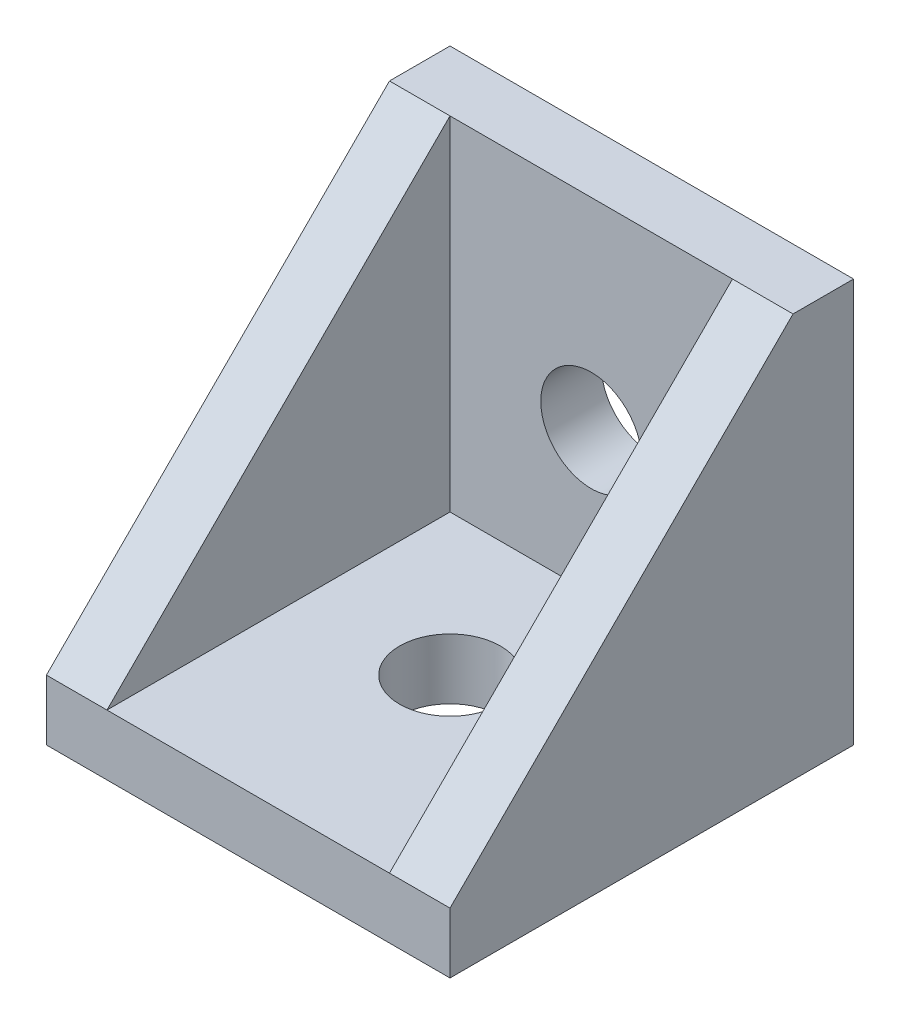
ISO-10303-21;
HEADER;
FILE_DESCRIPTION(('STEP AP214'),'2;1');
FILE_NAME('part.step','',(''),(''),'','','');
FILE_SCHEMA(('AUTOMOTIVE_DESIGN { 1 0 10303 214 1 1 1 1 }'));
ENDSEC;
DATA;
#1=APPLICATION_CONTEXT('core data for automotive mechanical design processes');
#2=APPLICATION_PROTOCOL_DEFINITION('international standard','automotive_design',2000,#1);
#3=PRODUCT_CONTEXT('',#1,'mechanical');
#4=PRODUCT('Part','Part','',(#3));
#5=PRODUCT_RELATED_PRODUCT_CATEGORY('part','',(#4));
#6=PRODUCT_DEFINITION_FORMATION('','',#4);
#7=PRODUCT_DEFINITION_CONTEXT('part definition',#1,'design');
#8=PRODUCT_DEFINITION('design','',#6,#7);
#9=PRODUCT_DEFINITION_SHAPE('','',#8);
#10=(LENGTH_UNIT() NAMED_UNIT(*) SI_UNIT(.MILLI.,.METRE.));
#11=(NAMED_UNIT(*) PLANE_ANGLE_UNIT() SI_UNIT($,.RADIAN.));
#12=(NAMED_UNIT(*) SI_UNIT($,.STERADIAN.) SOLID_ANGLE_UNIT());
#13=UNCERTAINTY_MEASURE_WITH_UNIT(LENGTH_MEASURE(1.E-05),#10,'distance_accuracy_value','');
#14=(GEOMETRIC_REPRESENTATION_CONTEXT(3) GLOBAL_UNCERTAINTY_ASSIGNED_CONTEXT((#13)) GLOBAL_UNIT_ASSIGNED_CONTEXT((#10,
#11,#12)) REPRESENTATION_CONTEXT('',''));
#15=CARTESIAN_POINT('',(0.,0.,0.));
#16=DIRECTION('',(0.,0.,1.));
#17=DIRECTION('',(1.,0.,0.));
#18=AXIS2_PLACEMENT_3D('',#15,#16,#17);
#19=CARTESIAN_POINT('',(-20.,3.,20.));
#20=DIRECTION('',(0.,-0.707106781186547,-0.707106781186548));
#21=DIRECTION('',(0.,-0.707106781186548,0.707106781186547));
#22=AXIS2_PLACEMENT_3D('',#19,#20,#21);
#23=PLANE('',#22);
#24=DIRECTION('',(0.,0.707106781186548,-0.707106781186547));
#25=VECTOR('',#24,1.);
#26=CARTESIAN_POINT('',(-3.,11.5,11.5));
#27=LINE('',#26,#25);
#28=CARTESIAN_POINT('',(-3.,3.,20.));
#29=VERTEX_POINT('',#28);
#30=CARTESIAN_POINT('',(-3.,20.,3.));
#31=VERTEX_POINT('',#30);
#32=EDGE_CURVE('E137',#29,#31,#27,.T.);
#33=ORIENTED_EDGE('',*,*,#32,.F.);
#34=DIRECTION('',(-1.,0.,0.));
#35=VECTOR('',#34,1.);
#36=CARTESIAN_POINT('',(-20.,3.,20.));
#37=LINE('',#36,#35);
#38=CARTESIAN_POINT('',(0.,3.,20.));
#39=VERTEX_POINT('',#38);
#40=EDGE_CURVE('E42',#39,#29,#37,.T.);
#41=ORIENTED_EDGE('',*,*,#40,.F.);
#42=DIRECTION('',(0.,-0.707106781186548,0.707106781186547));
#43=VECTOR('',#42,1.);
#44=CARTESIAN_POINT('',(0.,2.25,20.75));
#45=LINE('',#44,#43);
#46=CARTESIAN_POINT('',(0.,20.,3.));
#47=VERTEX_POINT('',#46);
#48=EDGE_CURVE('E153',#47,#39,#45,.T.);
#49=ORIENTED_EDGE('',*,*,#48,.F.);
#50=DIRECTION('',(1.,0.,0.));
#51=VECTOR('',#50,1.);
#52=CARTESIAN_POINT('',(-15.,20.,3.));
#53=LINE('',#52,#51);
#54=EDGE_CURVE('E150',#31,#47,#53,.T.);
#55=ORIENTED_EDGE('',*,*,#54,.F.);
#56=EDGE_LOOP('',(#33,#41,#49,#55));
#57=FACE_BOUND('',#56,.T.);
#58=ADVANCED_FACE('F17',(#57),#23,.F.);
#59=CARTESIAN_POINT('',(-20.,3.,20.));
#60=DIRECTION('',(0.,-0.707106781186547,-0.707106781186548));
#61=DIRECTION('',(0.,-0.707106781186548,0.707106781186547));
#62=AXIS2_PLACEMENT_3D('',#59,#60,#61);
#63=PLANE('',#62);
#64=DIRECTION('',(0.,-0.707106781186548,0.707106781186547));
#65=VECTOR('',#64,1.);
#66=CARTESIAN_POINT('',(-17.,7.25,15.75));
#67=LINE('',#66,#65);
#68=CARTESIAN_POINT('',(-17.,20.,3.));
#69=VERTEX_POINT('',#68);
#70=CARTESIAN_POINT('',(-17.,3.,20.));
#71=VERTEX_POINT('',#70);
#72=EDGE_CURVE('E219',#69,#71,#67,.T.);
#73=ORIENTED_EDGE('',*,*,#72,.F.);
#74=DIRECTION('',(1.,0.,0.));
#75=VECTOR('',#74,1.);
#76=CARTESIAN_POINT('',(-15.,20.,3.));
#77=LINE('',#76,#75);
#78=CARTESIAN_POINT('',(-20.,20.,3.));
#79=VERTEX_POINT('',#78);
#80=EDGE_CURVE('E162',#79,#69,#77,.T.);
#81=ORIENTED_EDGE('',*,*,#80,.F.);
#82=DIRECTION('',(0.,0.707106781186548,-0.707106781186547));
#83=VECTOR('',#82,1.);
#84=CARTESIAN_POINT('',(-20.,7.25,15.75));
#85=LINE('',#84,#83);
#86=CARTESIAN_POINT('',(-20.,3.,20.));
#87=VERTEX_POINT('',#86);
#88=EDGE_CURVE('E11',#87,#79,#85,.T.);
#89=ORIENTED_EDGE('',*,*,#88,.F.);
#90=DIRECTION('',(-1.,0.,0.));
#91=VECTOR('',#90,1.);
#92=CARTESIAN_POINT('',(-20.,3.,20.));
#93=LINE('',#92,#91);
#94=EDGE_CURVE('E189',#71,#87,#93,.T.);
#95=ORIENTED_EDGE('',*,*,#94,.F.);
#96=EDGE_LOOP('',(#73,#81,#89,#95));
#97=FACE_BOUND('',#96,.T.);
#98=ADVANCED_FACE('F276',(#97),#63,.F.);
#99=CARTESIAN_POINT('',(-20.,0.,0.));
#100=DIRECTION('',(-1.,0.,0.));
#101=DIRECTION('',(0.,0.,1.));
#102=AXIS2_PLACEMENT_3D('',#99,#100,#101);
#103=PLANE('',#102);
#104=ORIENTED_EDGE('',*,*,#88,.T.);
#105=DIRECTION('',(0.,0.,1.));
#106=VECTOR('',#105,1.);
#107=CARTESIAN_POINT('',(-20.,20.,0.));
#108=LINE('',#107,#106);
#109=CARTESIAN_POINT('',(-20.,20.,0.));
#110=VERTEX_POINT('',#109);
#111=EDGE_CURVE('E329',#110,#79,#108,.T.);
#112=ORIENTED_EDGE('',*,*,#111,.F.);
#113=DIRECTION('',(0.,1.,0.));
#114=VECTOR('',#113,1.);
#115=CARTESIAN_POINT('',(-20.,0.,0.));
#116=LINE('',#115,#114);
#117=CARTESIAN_POINT('',(-20.,0.,0.));
#118=VERTEX_POINT('',#117);
#119=EDGE_CURVE('E179',#118,#110,#116,.T.);
#120=ORIENTED_EDGE('',*,*,#119,.F.);
#121=DIRECTION('',(0.,0.,1.));
#122=VECTOR('',#121,1.);
#123=CARTESIAN_POINT('',(-20.,0.,0.));
#124=LINE('',#123,#122);
#125=CARTESIAN_POINT('',(-20.,0.,20.));
#126=VERTEX_POINT('',#125);
#127=EDGE_CURVE('E28',#118,#126,#124,.T.);
#128=ORIENTED_EDGE('',*,*,#127,.T.);
#129=DIRECTION('',(0.,1.,0.));
#130=VECTOR('',#129,1.);
#131=CARTESIAN_POINT('',(-20.,0.,20.));
#132=LINE('',#131,#130);
#133=EDGE_CURVE('E222',#126,#87,#132,.T.);
#134=ORIENTED_EDGE('',*,*,#133,.T.);
#135=EDGE_LOOP('',(#104,#112,#120,#128,#134));
#136=FACE_BOUND('',#135,.T.);
#137=ADVANCED_FACE('F280',(#136),#103,.T.);
#138=CARTESIAN_POINT('',(-17.,20.,20.));
#139=DIRECTION('',(-1.,0.,0.));
#140=DIRECTION('',(0.,0.,1.));
#141=AXIS2_PLACEMENT_3D('',#138,#139,#140);
#142=PLANE('',#141);
#143=ORIENTED_EDGE('',*,*,#72,.T.);
#144=DIRECTION('',(0.,0.,-1.));
#145=VECTOR('',#144,1.);
#146=CARTESIAN_POINT('',(-17.,3.,20.));
#147=LINE('',#146,#145);
#148=CARTESIAN_POINT('',(-17.,3.,3.));
#149=VERTEX_POINT('',#148);
#150=EDGE_CURVE('E216',#71,#149,#147,.T.);
#151=ORIENTED_EDGE('',*,*,#150,.T.);
#152=DIRECTION('',(0.,-1.,0.));
#153=VECTOR('',#152,1.);
#154=CARTESIAN_POINT('',(-17.,20.,3.));
#155=LINE('',#154,#153);
#156=EDGE_CURVE('E109',#69,#149,#155,.T.);
#157=ORIENTED_EDGE('',*,*,#156,.F.);
#158=EDGE_LOOP('',(#143,#151,#157));
#159=FACE_BOUND('',#158,.T.);
#160=ADVANCED_FACE('F284',(#159),#142,.F.);
#161=CARTESIAN_POINT('',(-10.,20.,10.));
#162=DIRECTION('',(0.,1.,0.));
#163=DIRECTION('',(1.,0.,0.));
#164=AXIS2_PLACEMENT_3D('',#161,#162,#163);
#165=PLANE('',#164);
#166=ORIENTED_EDGE('',*,*,#80,.T.);
#167=DIRECTION('',(1.,0.,0.));
#168=VECTOR('',#167,1.);
#169=CARTESIAN_POINT('',(-13.5,20.,3.));
#170=LINE('',#169,#168);
#171=EDGE_CURVE('E157',#69,#31,#170,.T.);
#172=ORIENTED_EDGE('',*,*,#171,.T.);
#173=ORIENTED_EDGE('',*,*,#54,.T.);
#174=DIRECTION('',(0.,0.,-1.));
#175=VECTOR('',#174,1.);
#176=CARTESIAN_POINT('',(0.,20.,20.));
#177=LINE('',#176,#175);
#178=CARTESIAN_POINT('',(0.,20.,0.));
#179=VERTEX_POINT('',#178);
#180=EDGE_CURVE('E158',#47,#179,#177,.T.);
#181=ORIENTED_EDGE('',*,*,#180,.T.);
#182=DIRECTION('',(-1.,0.,0.));
#183=VECTOR('',#182,1.);
#184=CARTESIAN_POINT('',(0.,20.,0.));
#185=LINE('',#184,#183);
#186=EDGE_CURVE('E117',#179,#110,#185,.T.);
#187=ORIENTED_EDGE('',*,*,#186,.T.);
#188=ORIENTED_EDGE('',*,*,#111,.T.);
#189=EDGE_LOOP('',(#166,#172,#173,#181,#187,#188));
#190=FACE_BOUND('',#189,.T.);
#191=ADVANCED_FACE('F160',(#190),#165,.T.);
#192=CARTESIAN_POINT('',(0.,0.,20.));
#193=DIRECTION('',(1.,0.,0.));
#194=DIRECTION('',(0.,1.,0.));
#195=AXIS2_PLACEMENT_3D('',#192,#193,#194);
#196=PLANE('',#195);
#197=ORIENTED_EDGE('',*,*,#48,.T.);
#198=DIRECTION('',(0.,1.,0.));
#199=VECTOR('',#198,1.);
#200=CARTESIAN_POINT('',(0.,0.,20.));
#201=LINE('',#200,#199);
#202=CARTESIAN_POINT('',(0.,0.,20.));
#203=VERTEX_POINT('',#202);
#204=EDGE_CURVE('E190',#203,#39,#201,.T.);
#205=ORIENTED_EDGE('',*,*,#204,.F.);
#206=DIRECTION('',(0.,0.,-1.));
#207=VECTOR('',#206,1.);
#208=CARTESIAN_POINT('',(0.,0.,20.));
#209=LINE('',#208,#207);
#210=CARTESIAN_POINT('',(0.,0.,0.));
#211=VERTEX_POINT('',#210);
#212=EDGE_CURVE('E227',#203,#211,#209,.T.);
#213=ORIENTED_EDGE('',*,*,#212,.T.);
#214=DIRECTION('',(0.,1.,0.));
#215=VECTOR('',#214,1.);
#216=CARTESIAN_POINT('',(0.,0.,0.));
#217=LINE('',#216,#215);
#218=EDGE_CURVE('E147',#211,#179,#217,.T.);
#219=ORIENTED_EDGE('',*,*,#218,.T.);
#220=ORIENTED_EDGE('',*,*,#180,.F.);
#221=EDGE_LOOP('',(#197,#205,#213,#219,#220));
#222=FACE_BOUND('',#221,.T.);
#223=ADVANCED_FACE('F235',(#222),#196,.T.);
#224=CARTESIAN_POINT('',(-3.,20.,3.));
#225=DIRECTION('',(1.,0.,0.));
#226=DIRECTION('',(0.,1.,0.));
#227=AXIS2_PLACEMENT_3D('',#224,#225,#226);
#228=PLANE('',#227);
#229=ORIENTED_EDGE('',*,*,#32,.T.);
#230=DIRECTION('',(0.,-1.,0.));
#231=VECTOR('',#230,1.);
#232=CARTESIAN_POINT('',(-3.,20.,3.));
#233=LINE('',#232,#231);
#234=CARTESIAN_POINT('',(-3.,3.,3.));
#235=VERTEX_POINT('',#234);
#236=EDGE_CURVE('E141',#31,#235,#233,.T.);
#237=ORIENTED_EDGE('',*,*,#236,.T.);
#238=DIRECTION('',(0.,0.,1.));
#239=VECTOR('',#238,1.);
#240=CARTESIAN_POINT('',(-3.,3.,20.));
#241=LINE('',#240,#239);
#242=EDGE_CURVE('E143',#235,#29,#241,.T.);
#243=ORIENTED_EDGE('',*,*,#242,.T.);
#244=EDGE_LOOP('',(#229,#237,#243));
#245=FACE_BOUND('',#244,.T.);
#246=ADVANCED_FACE('F139',(#245),#228,.F.);
#247=CARTESIAN_POINT('',(-17.,20.,3.));
#248=DIRECTION('',(0.,0.,-1.));
#249=DIRECTION('',(0.,-1.,0.));
#250=AXIS2_PLACEMENT_3D('',#247,#248,#249);
#251=PLANE('',#250);
#252=ORIENTED_EDGE('',*,*,#171,.F.);
#253=ORIENTED_EDGE('',*,*,#156,.T.);
#254=DIRECTION('',(1.,0.,0.));
#255=VECTOR('',#254,1.);
#256=CARTESIAN_POINT('',(-3.,3.,3.));
#257=LINE('',#256,#255);
#258=EDGE_CURVE('E169',#149,#235,#257,.T.);
#259=ORIENTED_EDGE('',*,*,#258,.T.);
#260=ORIENTED_EDGE('',*,*,#236,.F.);
#261=EDGE_LOOP('',(#252,#253,#259,#260));
#262=FACE_BOUND('',#261,.T.);
#263=CARTESIAN_POINT('',(-10.,10.,3.));
#264=DIRECTION('',(0.,0.,1.));
#265=DIRECTION('',(1.,0.,0.));
#266=AXIS2_PLACEMENT_3D('',#263,#264,#265);
#267=CIRCLE('',#266,2.5);
#268=CARTESIAN_POINT('',(-12.5,10.,3.));
#269=VERTEX_POINT('',#268);
#270=EDGE_CURVE('E209',#269,#269,#267,.T.);
#271=ORIENTED_EDGE('',*,*,#270,.F.);
#272=EDGE_LOOP('',(#271));
#273=FACE_BOUND('',#272,.T.);
#274=ADVANCED_FACE('F166',(#262,#273),#251,.F.);
#275=CARTESIAN_POINT('',(-10.,3.,11.5));
#276=DIRECTION('',(0.,1.,0.));
#277=DIRECTION('',(1.,0.,0.));
#278=AXIS2_PLACEMENT_3D('',#275,#276,#277);
#279=PLANE('',#278);
#280=DIRECTION('',(-1.,0.,0.));
#281=VECTOR('',#280,1.);
#282=CARTESIAN_POINT('',(-15.,3.,20.));
#283=LINE('',#282,#281);
#284=EDGE_CURVE('E201',#29,#71,#283,.T.);
#285=ORIENTED_EDGE('',*,*,#284,.F.);
#286=ORIENTED_EDGE('',*,*,#242,.F.);
#287=ORIENTED_EDGE('',*,*,#258,.F.);
#288=ORIENTED_EDGE('',*,*,#150,.F.);
#289=EDGE_LOOP('',(#285,#286,#287,#288));
#290=FACE_BOUND('',#289,.T.);
#291=CARTESIAN_POINT('',(-10.,3.,10.));
#292=DIRECTION('',(0.,1.,0.));
#293=DIRECTION('',(1.,0.,0.));
#294=AXIS2_PLACEMENT_3D('',#291,#292,#293);
#295=CIRCLE('',#294,2.5);
#296=CARTESIAN_POINT('',(-7.5,3.,10.));
#297=VERTEX_POINT('',#296);
#298=CARTESIAN_POINT('',(-12.5,3.,10.));
#299=VERTEX_POINT('',#298);
#300=EDGE_CURVE('E181',#297,#299,#295,.T.);
#301=ORIENTED_EDGE('',*,*,#300,.F.);
#302=CARTESIAN_POINT('',(-10.,3.,10.));
#303=DIRECTION('',(0.,1.,0.));
#304=DIRECTION('',(1.,0.,0.));
#305=AXIS2_PLACEMENT_3D('',#302,#303,#304);
#306=CIRCLE('',#305,2.5);
#307=EDGE_CURVE('E245',#299,#297,#306,.T.);
#308=ORIENTED_EDGE('',*,*,#307,.F.);
#309=EDGE_LOOP('',(#301,#308));
#310=FACE_BOUND('',#309,.T.);
#311=ADVANCED_FACE('F262',(#290,#310),#279,.T.);
#312=CARTESIAN_POINT('',(-20.,0.,20.));
#313=DIRECTION('',(0.,0.,1.));
#314=DIRECTION('',(1.,0.,0.));
#315=AXIS2_PLACEMENT_3D('',#312,#313,#314);
#316=PLANE('',#315);
#317=ORIENTED_EDGE('',*,*,#94,.T.);
#318=ORIENTED_EDGE('',*,*,#133,.F.);
#319=DIRECTION('',(1.,0.,0.));
#320=VECTOR('',#319,1.);
#321=CARTESIAN_POINT('',(-20.,0.,20.));
#322=LINE('',#321,#320);
#323=EDGE_CURVE('E186',#126,#203,#322,.T.);
#324=ORIENTED_EDGE('',*,*,#323,.T.);
#325=ORIENTED_EDGE('',*,*,#204,.T.);
#326=ORIENTED_EDGE('',*,*,#40,.T.);
#327=ORIENTED_EDGE('',*,*,#284,.T.);
#328=EDGE_LOOP('',(#317,#318,#324,#325,#326,#327));
#329=FACE_BOUND('',#328,.T.);
#330=ADVANCED_FACE('F269',(#329),#316,.T.);
#331=CARTESIAN_POINT('',(-10.,10.,20.));
#332=DIRECTION('',(0.,0.,-1.));
#333=DIRECTION('',(1.,0.,0.));
#334=AXIS2_PLACEMENT_3D('',#331,#332,#333);
#335=CYLINDRICAL_SURFACE('',#334,2.5);
#336=ORIENTED_EDGE('',*,*,#270,.T.);
#337=DIRECTION('',(0.,0.,-1.));
#338=VECTOR('',#337,1.);
#339=CARTESIAN_POINT('',(-12.5,10.,20.));
#340=LINE('',#339,#338);
#341=CARTESIAN_POINT('',(-12.5,10.,0.));
#342=VERTEX_POINT('',#341);
#343=EDGE_CURVE('E184',#269,#342,#340,.T.);
#344=ORIENTED_EDGE('',*,*,#343,.T.);
#345=CARTESIAN_POINT('',(-10.,10.,0.));
#346=DIRECTION('',(0.,0.,1.));
#347=DIRECTION('',(1.,0.,0.));
#348=AXIS2_PLACEMENT_3D('',#345,#346,#347);
#349=CIRCLE('',#348,2.5);
#350=EDGE_CURVE('E21',#342,#342,#349,.T.);
#351=ORIENTED_EDGE('',*,*,#350,.F.);
#352=ORIENTED_EDGE('',*,*,#343,.F.);
#353=EDGE_LOOP('',(#336,#344,#351,#352));
#354=FACE_BOUND('',#353,.T.);
#355=ADVANCED_FACE('F19',(#354),#335,.F.);
#356=CARTESIAN_POINT('',(-10.,0.,10.));
#357=DIRECTION('',(0.,1.,0.));
#358=DIRECTION('',(1.,0.,0.));
#359=AXIS2_PLACEMENT_3D('',#356,#357,#358);
#360=CYLINDRICAL_SURFACE('',#359,2.5);
#361=ORIENTED_EDGE('',*,*,#300,.T.);
#362=DIRECTION('',(0.,-1.,0.));
#363=VECTOR('',#362,1.);
#364=CARTESIAN_POINT('',(-12.5,0.,10.));
#365=LINE('',#364,#363);
#366=CARTESIAN_POINT('',(-12.5,0.,10.));
#367=VERTEX_POINT('',#366);
#368=EDGE_CURVE('E185',#299,#367,#365,.T.);
#369=ORIENTED_EDGE('',*,*,#368,.T.);
#370=CARTESIAN_POINT('',(-10.,0.,10.));
#371=DIRECTION('',(0.,-1.,0.));
#372=DIRECTION('',(1.,0.,0.));
#373=AXIS2_PLACEMENT_3D('',#370,#371,#372);
#374=CIRCLE('',#373,2.5);
#375=EDGE_CURVE('E251',#367,#367,#374,.T.);
#376=ORIENTED_EDGE('',*,*,#375,.T.);
#377=ORIENTED_EDGE('',*,*,#368,.F.);
#378=ORIENTED_EDGE('',*,*,#307,.T.);
#379=EDGE_LOOP('',(#361,#369,#376,#377,#378));
#380=FACE_BOUND('',#379,.T.);
#381=ADVANCED_FACE('F299',(#380),#360,.F.);
#382=CARTESIAN_POINT('',(0.,0.,0.));
#383=DIRECTION('',(0.,0.,-1.));
#384=DIRECTION('',(0.,-1.,0.));
#385=AXIS2_PLACEMENT_3D('',#382,#383,#384);
#386=PLANE('',#385);
#387=DIRECTION('',(-1.,0.,0.));
#388=VECTOR('',#387,1.);
#389=CARTESIAN_POINT('',(0.,0.,0.));
#390=LINE('',#389,#388);
#391=EDGE_CURVE('E204',#211,#118,#390,.T.);
#392=ORIENTED_EDGE('',*,*,#391,.T.);
#393=ORIENTED_EDGE('',*,*,#119,.T.);
#394=ORIENTED_EDGE('',*,*,#186,.F.);
#395=ORIENTED_EDGE('',*,*,#218,.F.);
#396=EDGE_LOOP('',(#392,#393,#394,#395));
#397=FACE_BOUND('',#396,.T.);
#398=ORIENTED_EDGE('',*,*,#350,.T.);
#399=EDGE_LOOP('',(#398));
#400=FACE_BOUND('',#399,.T.);
#401=ADVANCED_FACE('F239',(#397,#400),#386,.T.);
#402=CARTESIAN_POINT('',(-10.,0.,10.));
#403=DIRECTION('',(0.,1.,0.));
#404=DIRECTION('',(1.,0.,0.));
#405=AXIS2_PLACEMENT_3D('',#402,#403,#404);
#406=PLANE('',#405);
#407=ORIENTED_EDGE('',*,*,#212,.F.);
#408=ORIENTED_EDGE('',*,*,#323,.F.);
#409=ORIENTED_EDGE('',*,*,#127,.F.);
#410=ORIENTED_EDGE('',*,*,#391,.F.);
#411=EDGE_LOOP('',(#407,#408,#409,#410));
#412=FACE_BOUND('',#411,.T.);
#413=ORIENTED_EDGE('',*,*,#375,.F.);
#414=EDGE_LOOP('',(#413));
#415=FACE_BOUND('',#414,.T.);
#416=ADVANCED_FACE('F298',(#412,#415),#406,.F.);
#417=CLOSED_SHELL('',(#58,#98,#137,#160,#191,#223,#246,#274,#311,#330,#355,#381,#401,#416));
#418=MANIFOLD_SOLID_BREP('B1',#417);
#419=ADVANCED_BREP_SHAPE_REPRESENTATION('',(#18,#418),#14);
#420=SHAPE_DEFINITION_REPRESENTATION(#9,#419);
ENDSEC;
END-ISO-10303-21;
